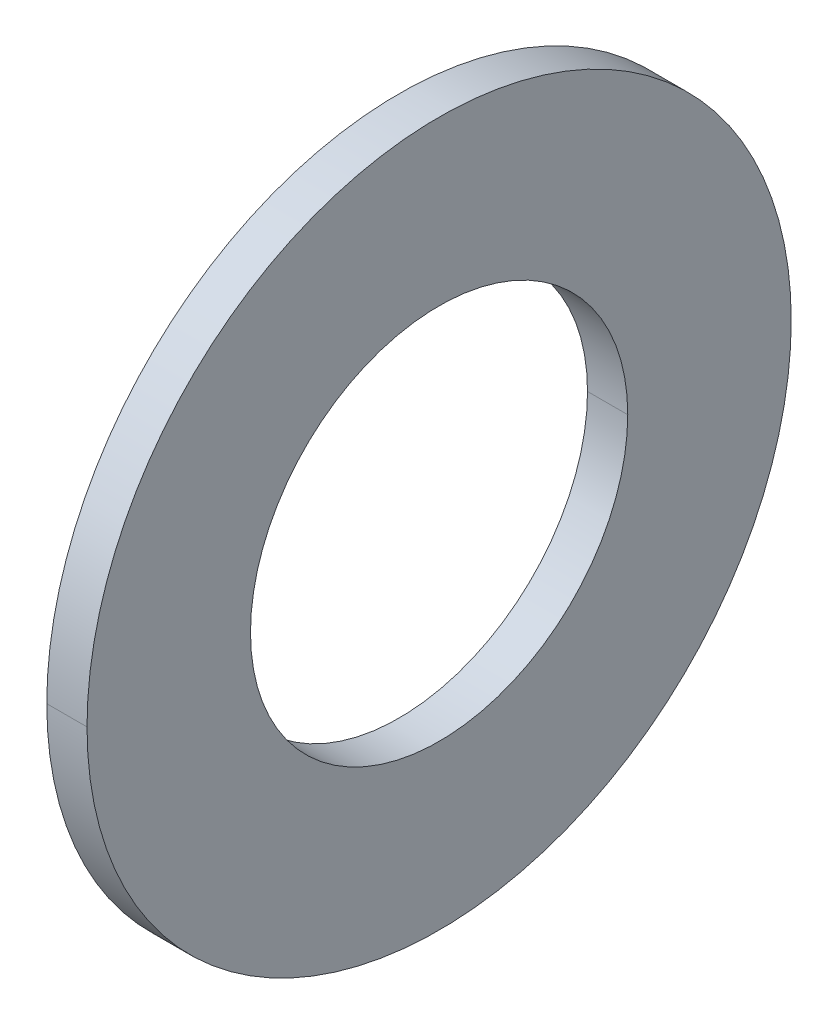
ISO-10303-21;
HEADER;
FILE_DESCRIPTION(('STEP AP214'),'2;1');
FILE_NAME('part.step','',(''),(''),'','','');
FILE_SCHEMA(('AUTOMOTIVE_DESIGN { 1 0 10303 214 1 1 1 1 }'));
ENDSEC;
DATA;
#1=APPLICATION_CONTEXT('core data for automotive mechanical design processes');
#2=APPLICATION_PROTOCOL_DEFINITION('international standard','automotive_design',2000,#1);
#3=PRODUCT_CONTEXT('',#1,'mechanical');
#4=PRODUCT('Part','Part','',(#3));
#5=PRODUCT_RELATED_PRODUCT_CATEGORY('part','',(#4));
#6=PRODUCT_DEFINITION_FORMATION('','',#4);
#7=PRODUCT_DEFINITION_CONTEXT('part definition',#1,'design');
#8=PRODUCT_DEFINITION('design','',#6,#7);
#9=PRODUCT_DEFINITION_SHAPE('','',#8);
#10=(LENGTH_UNIT() NAMED_UNIT(*) SI_UNIT(.MILLI.,.METRE.));
#11=(NAMED_UNIT(*) PLANE_ANGLE_UNIT() SI_UNIT($,.RADIAN.));
#12=(NAMED_UNIT(*) SI_UNIT($,.STERADIAN.) SOLID_ANGLE_UNIT());
#13=UNCERTAINTY_MEASURE_WITH_UNIT(LENGTH_MEASURE(1.E-05),#10,'distance_accuracy_value','');
#14=(GEOMETRIC_REPRESENTATION_CONTEXT(3) GLOBAL_UNCERTAINTY_ASSIGNED_CONTEXT((#13)) GLOBAL_UNIT_ASSIGNED_CONTEXT((#10,
#11,#12)) REPRESENTATION_CONTEXT('',''));
#15=CARTESIAN_POINT('',(0.,0.,0.));
#16=DIRECTION('',(0.,0.,1.));
#17=DIRECTION('',(1.,0.,0.));
#18=AXIS2_PLACEMENT_3D('',#15,#16,#17);
#19=CARTESIAN_POINT('',(0.8,0.,0.));
#20=DIRECTION('',(-1.,0.,0.));
#21=DIRECTION('',(0.,1.,0.));
#22=AXIS2_PLACEMENT_3D('',#19,#20,#21);
#23=CYLINDRICAL_SURFACE('',#22,7.5);
#24=DIRECTION('',(-1.,0.,0.));
#25=VECTOR('',#24,1.);
#26=CARTESIAN_POINT('',(0.8,0.,-7.5));
#27=LINE('',#26,#25);
#28=CARTESIAN_POINT('',(0.8,0.,-7.5));
#29=VERTEX_POINT('',#28);
#30=CARTESIAN_POINT('',(-0.8,0.,-7.5));
#31=VERTEX_POINT('',#30);
#32=EDGE_CURVE('E11',#29,#31,#27,.T.);
#33=ORIENTED_EDGE('',*,*,#32,.T.);
#34=CARTESIAN_POINT('',(-0.8,0.,0.));
#35=DIRECTION('',(1.,0.,0.));
#36=DIRECTION('',(0.,0.,-1.));
#37=AXIS2_PLACEMENT_3D('',#34,#35,#36);
#38=CIRCLE('',#37,7.5);
#39=CARTESIAN_POINT('',(-0.8,0.,7.5));
#40=VERTEX_POINT('',#39);
#41=EDGE_CURVE('E25',#40,#31,#38,.T.);
#42=ORIENTED_EDGE('',*,*,#41,.F.);
#43=DIRECTION('',(-1.,0.,0.));
#44=VECTOR('',#43,1.);
#45=CARTESIAN_POINT('',(0.8,0.,7.5));
#46=LINE('',#45,#44);
#47=CARTESIAN_POINT('',(0.8,0.,7.5));
#48=VERTEX_POINT('',#47);
#49=EDGE_CURVE('E94',#48,#40,#46,.T.);
#50=ORIENTED_EDGE('',*,*,#49,.F.);
#51=CARTESIAN_POINT('',(0.8,0.,0.));
#52=DIRECTION('',(1.,0.,0.));
#53=DIRECTION('',(0.,0.,-1.));
#54=AXIS2_PLACEMENT_3D('',#51,#52,#53);
#55=CIRCLE('',#54,7.5);
#56=EDGE_CURVE('E90',#48,#29,#55,.T.);
#57=ORIENTED_EDGE('',*,*,#56,.T.);
#58=EDGE_LOOP('',(#33,#42,#50,#57));
#59=FACE_BOUND('',#58,.T.);
#60=ADVANCED_FACE('F17',(#59),#23,.F.);
#61=CARTESIAN_POINT('',(0.8,0.,0.));
#62=DIRECTION('',(1.,0.,0.));
#63=DIRECTION('',(0.,0.,-1.));
#64=AXIS2_PLACEMENT_3D('',#61,#62,#63);
#65=PLANE('',#64);
#66=ORIENTED_EDGE('',*,*,#56,.F.);
#67=CARTESIAN_POINT('',(0.8,0.,0.));
#68=DIRECTION('',(1.,0.,0.));
#69=DIRECTION('',(0.,0.,-1.));
#70=AXIS2_PLACEMENT_3D('',#67,#68,#69);
#71=CIRCLE('',#70,7.5);
#72=EDGE_CURVE('E85',#29,#48,#71,.T.);
#73=ORIENTED_EDGE('',*,*,#72,.F.);
#74=EDGE_LOOP('',(#66,#73));
#75=FACE_BOUND('',#74,.T.);
#76=CARTESIAN_POINT('',(0.8,0.,0.));
#77=DIRECTION('',(1.,0.,0.));
#78=DIRECTION('',(0.,0.,-1.));
#79=AXIS2_PLACEMENT_3D('',#76,#77,#78);
#80=CIRCLE('',#79,14.);
#81=CARTESIAN_POINT('',(0.8,0.,-14.));
#82=VERTEX_POINT('',#81);
#83=CARTESIAN_POINT('',(0.8,0.,14.));
#84=VERTEX_POINT('',#83);
#85=EDGE_CURVE('E72',#82,#84,#80,.T.);
#86=ORIENTED_EDGE('',*,*,#85,.T.);
#87=CARTESIAN_POINT('',(0.8,0.,0.));
#88=DIRECTION('',(1.,0.,0.));
#89=DIRECTION('',(0.,0.,-1.));
#90=AXIS2_PLACEMENT_3D('',#87,#88,#89);
#91=CIRCLE('',#90,14.);
#92=EDGE_CURVE('E73',#84,#82,#91,.T.);
#93=ORIENTED_EDGE('',*,*,#92,.T.);
#94=EDGE_LOOP('',(#86,#93));
#95=FACE_BOUND('',#94,.T.);
#96=ADVANCED_FACE('F116',(#75,#95),#65,.T.);
#97=CARTESIAN_POINT('',(0.8,0.,0.));
#98=DIRECTION('',(-1.,0.,0.));
#99=DIRECTION('',(0.,1.,0.));
#100=AXIS2_PLACEMENT_3D('',#97,#98,#99);
#101=CYLINDRICAL_SURFACE('',#100,14.);
#102=DIRECTION('',(-1.,0.,0.));
#103=VECTOR('',#102,1.);
#104=CARTESIAN_POINT('',(0.8,0.,-14.));
#105=LINE('',#104,#103);
#106=CARTESIAN_POINT('',(-0.8,0.,-14.));
#107=VERTEX_POINT('',#106);
#108=EDGE_CURVE('E59',#82,#107,#105,.T.);
#109=ORIENTED_EDGE('',*,*,#108,.F.);
#110=ORIENTED_EDGE('',*,*,#92,.F.);
#111=DIRECTION('',(-1.,0.,0.));
#112=VECTOR('',#111,1.);
#113=CARTESIAN_POINT('',(0.8,0.,14.));
#114=LINE('',#113,#112);
#115=CARTESIAN_POINT('',(-0.8,0.,14.));
#116=VERTEX_POINT('',#115);
#117=EDGE_CURVE('E61',#84,#116,#114,.T.);
#118=ORIENTED_EDGE('',*,*,#117,.T.);
#119=CARTESIAN_POINT('',(-0.8,0.,0.));
#120=DIRECTION('',(1.,0.,0.));
#121=DIRECTION('',(0.,0.,-1.));
#122=AXIS2_PLACEMENT_3D('',#119,#120,#121);
#123=CIRCLE('',#122,14.);
#124=EDGE_CURVE('E54',#116,#107,#123,.T.);
#125=ORIENTED_EDGE('',*,*,#124,.T.);
#126=EDGE_LOOP('',(#109,#110,#118,#125));
#127=FACE_BOUND('',#126,.T.);
#128=ADVANCED_FACE('F56',(#127),#101,.T.);
#129=CARTESIAN_POINT('',(-0.8,0.,0.));
#130=DIRECTION('',(1.,0.,0.));
#131=DIRECTION('',(0.,0.,-1.));
#132=AXIS2_PLACEMENT_3D('',#129,#130,#131);
#133=PLANE('',#132);
#134=CARTESIAN_POINT('',(-0.8,0.,0.));
#135=DIRECTION('',(1.,0.,0.));
#136=DIRECTION('',(0.,0.,-1.));
#137=AXIS2_PLACEMENT_3D('',#134,#135,#136);
#138=CIRCLE('',#137,7.5);
#139=EDGE_CURVE('E64',#31,#40,#138,.T.);
#140=ORIENTED_EDGE('',*,*,#139,.T.);
#141=ORIENTED_EDGE('',*,*,#41,.T.);
#142=EDGE_LOOP('',(#140,#141));
#143=FACE_BOUND('',#142,.T.);
#144=ORIENTED_EDGE('',*,*,#124,.F.);
#145=CARTESIAN_POINT('',(-0.8,0.,0.));
#146=DIRECTION('',(1.,0.,0.));
#147=DIRECTION('',(0.,0.,-1.));
#148=AXIS2_PLACEMENT_3D('',#145,#146,#147);
#149=CIRCLE('',#148,14.);
#150=EDGE_CURVE('E66',#107,#116,#149,.T.);
#151=ORIENTED_EDGE('',*,*,#150,.F.);
#152=EDGE_LOOP('',(#144,#151));
#153=FACE_BOUND('',#152,.T.);
#154=ADVANCED_FACE('F67',(#143,#153),#133,.F.);
#155=CARTESIAN_POINT('',(0.8,0.,0.));
#156=DIRECTION('',(-1.,0.,0.));
#157=DIRECTION('',(0.,-1.,0.));
#158=AXIS2_PLACEMENT_3D('',#155,#156,#157);
#159=CYLINDRICAL_SURFACE('',#158,14.);
#160=ORIENTED_EDGE('',*,*,#108,.T.);
#161=ORIENTED_EDGE('',*,*,#150,.T.);
#162=ORIENTED_EDGE('',*,*,#117,.F.);
#163=ORIENTED_EDGE('',*,*,#85,.F.);
#164=EDGE_LOOP('',(#160,#161,#162,#163));
#165=FACE_BOUND('',#164,.T.);
#166=ADVANCED_FACE('F71',(#165),#159,.T.);
#167=CARTESIAN_POINT('',(0.8,0.,0.));
#168=DIRECTION('',(-1.,0.,0.));
#169=DIRECTION('',(0.,-1.,0.));
#170=AXIS2_PLACEMENT_3D('',#167,#168,#169);
#171=CYLINDRICAL_SURFACE('',#170,7.5);
#172=ORIENTED_EDGE('',*,*,#32,.F.);
#173=ORIENTED_EDGE('',*,*,#72,.T.);
#174=ORIENTED_EDGE('',*,*,#49,.T.);
#175=ORIENTED_EDGE('',*,*,#139,.F.);
#176=EDGE_LOOP('',(#172,#173,#174,#175));
#177=FACE_BOUND('',#176,.T.);
#178=ADVANCED_FACE('F112',(#177),#171,.F.);
#179=CLOSED_SHELL('',(#60,#96,#128,#154,#166,#178));
#180=MANIFOLD_SOLID_BREP('B1',#179);
#181=ADVANCED_BREP_SHAPE_REPRESENTATION('',(#18,#180),#14);
#182=SHAPE_DEFINITION_REPRESENTATION(#9,#181);
ENDSEC;
END-ISO-10303-21;
